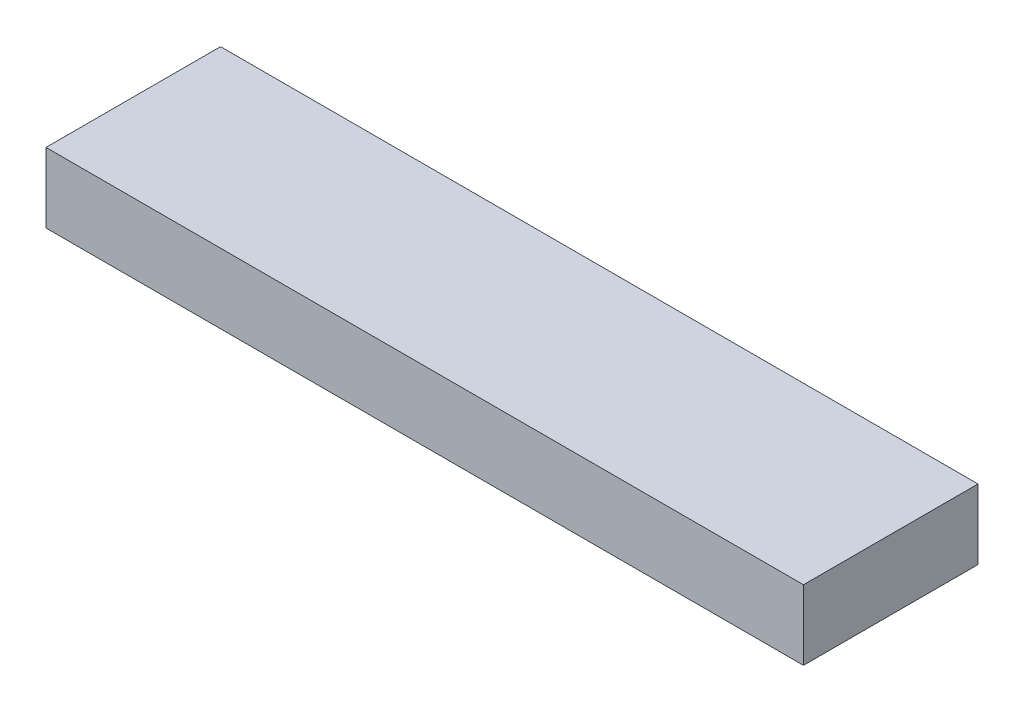
ISO-10303-21;
HEADER;
FILE_DESCRIPTION(('STEP AP214'),'2;1');
FILE_NAME('part.step','',(''),(''),'','','');
FILE_SCHEMA(('AUTOMOTIVE_DESIGN { 1 0 10303 214 1 1 1 1 }'));
ENDSEC;
DATA;
#1=APPLICATION_CONTEXT('core data for automotive mechanical design processes');
#2=APPLICATION_PROTOCOL_DEFINITION('international standard','automotive_design',2000,#1);
#3=PRODUCT_CONTEXT('',#1,'mechanical');
#4=PRODUCT('Part','Part','',(#3));
#5=PRODUCT_RELATED_PRODUCT_CATEGORY('part','',(#4));
#6=PRODUCT_DEFINITION_FORMATION('','',#4);
#7=PRODUCT_DEFINITION_CONTEXT('part definition',#1,'design');
#8=PRODUCT_DEFINITION('design','',#6,#7);
#9=PRODUCT_DEFINITION_SHAPE('','',#8);
#10=(LENGTH_UNIT() NAMED_UNIT(*) SI_UNIT(.MILLI.,.METRE.));
#11=(NAMED_UNIT(*) PLANE_ANGLE_UNIT() SI_UNIT($,.RADIAN.));
#12=(NAMED_UNIT(*) SI_UNIT($,.STERADIAN.) SOLID_ANGLE_UNIT());
#13=UNCERTAINTY_MEASURE_WITH_UNIT(LENGTH_MEASURE(1.E-05),#10,'distance_accuracy_value','');
#14=(GEOMETRIC_REPRESENTATION_CONTEXT(3) GLOBAL_UNCERTAINTY_ASSIGNED_CONTEXT((#13)) GLOBAL_UNIT_ASSIGNED_CONTEXT((#10,
#11,#12)) REPRESENTATION_CONTEXT('',''));
#15=CARTESIAN_POINT('',(0.,0.,0.));
#16=DIRECTION('',(0.,0.,1.));
#17=DIRECTION('',(1.,0.,0.));
#18=AXIS2_PLACEMENT_3D('',#15,#16,#17);
#19=CARTESIAN_POINT('',(0.,0.2,0.));
#20=DIRECTION('',(1.,0.,0.));
#21=DIRECTION('',(0.,0.,-1.));
#22=AXIS2_PLACEMENT_3D('',#19,#20,#21);
#23=PLANE('',#22);
#24=DIRECTION('',(0.,0.,1.));
#25=VECTOR('',#24,1.);
#26=CARTESIAN_POINT('',(0.,0.,0.));
#27=LINE('',#26,#25);
#28=CARTESIAN_POINT('',(0.,0.,-0.5));
#29=VERTEX_POINT('',#28);
#30=CARTESIAN_POINT('',(0.,0.,0.));
#31=VERTEX_POINT('',#30);
#32=EDGE_CURVE('E95',#29,#31,#27,.T.);
#33=ORIENTED_EDGE('',*,*,#32,.T.);
#34=DIRECTION('',(0.,-1.,0.));
#35=VECTOR('',#34,1.);
#36=CARTESIAN_POINT('',(0.,0.2,0.));
#37=LINE('',#36,#35);
#38=CARTESIAN_POINT('',(0.,0.2,0.));
#39=VERTEX_POINT('',#38);
#40=EDGE_CURVE('E11',#39,#31,#37,.T.);
#41=ORIENTED_EDGE('',*,*,#40,.F.);
#42=DIRECTION('',(0.,0.,1.));
#43=VECTOR('',#42,1.);
#44=CARTESIAN_POINT('',(0.,0.2,0.));
#45=LINE('',#44,#43);
#46=CARTESIAN_POINT('',(0.,0.2,-0.5));
#47=VERTEX_POINT('',#46);
#48=EDGE_CURVE('E83',#47,#39,#45,.T.);
#49=ORIENTED_EDGE('',*,*,#48,.F.);
#50=DIRECTION('',(0.,-1.,0.));
#51=VECTOR('',#50,1.);
#52=CARTESIAN_POINT('',(0.,0.2,-0.5));
#53=LINE('',#52,#51);
#54=EDGE_CURVE('E91',#47,#29,#53,.T.);
#55=ORIENTED_EDGE('',*,*,#54,.T.);
#56=EDGE_LOOP('',(#33,#41,#49,#55));
#57=FACE_BOUND('',#56,.T.);
#58=ADVANCED_FACE('F32',(#57),#23,.F.);
#59=CARTESIAN_POINT('',(0.,0.2,0.));
#60=DIRECTION('',(0.,0.,-1.));
#61=DIRECTION('',(-1.,0.,0.));
#62=AXIS2_PLACEMENT_3D('',#59,#60,#61);
#63=PLANE('',#62);
#64=DIRECTION('',(1.,0.,0.));
#65=VECTOR('',#64,1.);
#66=CARTESIAN_POINT('',(0.,0.,0.));
#67=LINE('',#66,#65);
#68=CARTESIAN_POINT('',(2.17,0.,0.));
#69=VERTEX_POINT('',#68);
#70=EDGE_CURVE('E87',#31,#69,#67,.T.);
#71=ORIENTED_EDGE('',*,*,#70,.T.);
#72=DIRECTION('',(0.,-1.,0.));
#73=VECTOR('',#72,1.);
#74=CARTESIAN_POINT('',(2.17,0.2,0.));
#75=LINE('',#74,#73);
#76=CARTESIAN_POINT('',(2.17,0.2,0.));
#77=VERTEX_POINT('',#76);
#78=EDGE_CURVE('E40',#77,#69,#75,.T.);
#79=ORIENTED_EDGE('',*,*,#78,.F.);
#80=DIRECTION('',(1.,0.,0.));
#81=VECTOR('',#80,1.);
#82=CARTESIAN_POINT('',(0.,0.2,0.));
#83=LINE('',#82,#81);
#84=EDGE_CURVE('E78',#39,#77,#83,.T.);
#85=ORIENTED_EDGE('',*,*,#84,.F.);
#86=ORIENTED_EDGE('',*,*,#40,.T.);
#87=EDGE_LOOP('',(#71,#79,#85,#86));
#88=FACE_BOUND('',#87,.T.);
#89=ADVANCED_FACE('F86',(#88),#63,.F.);
#90=CARTESIAN_POINT('',(2.17,0.2,0.));
#91=DIRECTION('',(-1.,0.,0.));
#92=DIRECTION('',(0.,0.,1.));
#93=AXIS2_PLACEMENT_3D('',#90,#91,#92);
#94=PLANE('',#93);
#95=DIRECTION('',(0.,0.,-1.));
#96=VECTOR('',#95,1.);
#97=CARTESIAN_POINT('',(2.17,0.,0.));
#98=LINE('',#97,#96);
#99=CARTESIAN_POINT('',(2.17,0.,-0.5));
#100=VERTEX_POINT('',#99);
#101=EDGE_CURVE('E65',#69,#100,#98,.T.);
#102=ORIENTED_EDGE('',*,*,#101,.T.);
#103=DIRECTION('',(0.,-1.,0.));
#104=VECTOR('',#103,1.);
#105=CARTESIAN_POINT('',(2.17,0.2,-0.5));
#106=LINE('',#105,#104);
#107=CARTESIAN_POINT('',(2.17,0.2,-0.5));
#108=VERTEX_POINT('',#107);
#109=EDGE_CURVE('E88',#108,#100,#106,.T.);
#110=ORIENTED_EDGE('',*,*,#109,.F.);
#111=DIRECTION('',(0.,0.,-1.));
#112=VECTOR('',#111,1.);
#113=CARTESIAN_POINT('',(2.17,0.2,0.));
#114=LINE('',#113,#112);
#115=EDGE_CURVE('E81',#77,#108,#114,.T.);
#116=ORIENTED_EDGE('',*,*,#115,.F.);
#117=ORIENTED_EDGE('',*,*,#78,.T.);
#118=EDGE_LOOP('',(#102,#110,#116,#117));
#119=FACE_BOUND('',#118,.T.);
#120=ADVANCED_FACE('F89',(#119),#94,.F.);
#121=CARTESIAN_POINT('',(0.,0.2,-0.5));
#122=DIRECTION('',(0.,0.,1.));
#123=DIRECTION('',(1.,0.,0.));
#124=AXIS2_PLACEMENT_3D('',#121,#122,#123);
#125=PLANE('',#124);
#126=DIRECTION('',(-1.,0.,0.));
#127=VECTOR('',#126,1.);
#128=CARTESIAN_POINT('',(0.,0.,-0.5));
#129=LINE('',#128,#127);
#130=EDGE_CURVE('E71',#100,#29,#129,.T.);
#131=ORIENTED_EDGE('',*,*,#130,.T.);
#132=ORIENTED_EDGE('',*,*,#54,.F.);
#133=DIRECTION('',(-1.,0.,0.));
#134=VECTOR('',#133,1.);
#135=CARTESIAN_POINT('',(0.,0.2,-0.5));
#136=LINE('',#135,#134);
#137=EDGE_CURVE('E48',#108,#47,#136,.T.);
#138=ORIENTED_EDGE('',*,*,#137,.F.);
#139=ORIENTED_EDGE('',*,*,#109,.T.);
#140=EDGE_LOOP('',(#131,#132,#138,#139));
#141=FACE_BOUND('',#140,.T.);
#142=ADVANCED_FACE('F102',(#141),#125,.F.);
#143=CARTESIAN_POINT('',(0.,0.2,-0.5));
#144=DIRECTION('',(0.,-1.,0.));
#145=DIRECTION('',(0.,0.,-1.));
#146=AXIS2_PLACEMENT_3D('',#143,#144,#145);
#147=PLANE('',#146);
#148=ORIENTED_EDGE('',*,*,#48,.T.);
#149=ORIENTED_EDGE('',*,*,#84,.T.);
#150=ORIENTED_EDGE('',*,*,#115,.T.);
#151=ORIENTED_EDGE('',*,*,#137,.T.);
#152=EDGE_LOOP('',(#148,#149,#150,#151));
#153=FACE_BOUND('',#152,.T.);
#154=ADVANCED_FACE('F79',(#153),#147,.F.);
#155=CARTESIAN_POINT('',(0.,0.,-0.5));
#156=DIRECTION('',(0.,-1.,0.));
#157=DIRECTION('',(0.,0.,-1.));
#158=AXIS2_PLACEMENT_3D('',#155,#156,#157);
#159=PLANE('',#158);
#160=ORIENTED_EDGE('',*,*,#32,.F.);
#161=ORIENTED_EDGE('',*,*,#130,.F.);
#162=ORIENTED_EDGE('',*,*,#101,.F.);
#163=ORIENTED_EDGE('',*,*,#70,.F.);
#164=EDGE_LOOP('',(#160,#161,#162,#163));
#165=FACE_BOUND('',#164,.T.);
#166=ADVANCED_FACE('F105',(#165),#159,.T.);
#167=CLOSED_SHELL('',(#58,#89,#120,#142,#154,#166));
#168=MANIFOLD_SOLID_BREP('B2',#167);
#169=ADVANCED_BREP_SHAPE_REPRESENTATION('',(#18,#168),#14);
#170=SHAPE_DEFINITION_REPRESENTATION(#9,#169);
ENDSEC;
END-ISO-10303-21;
